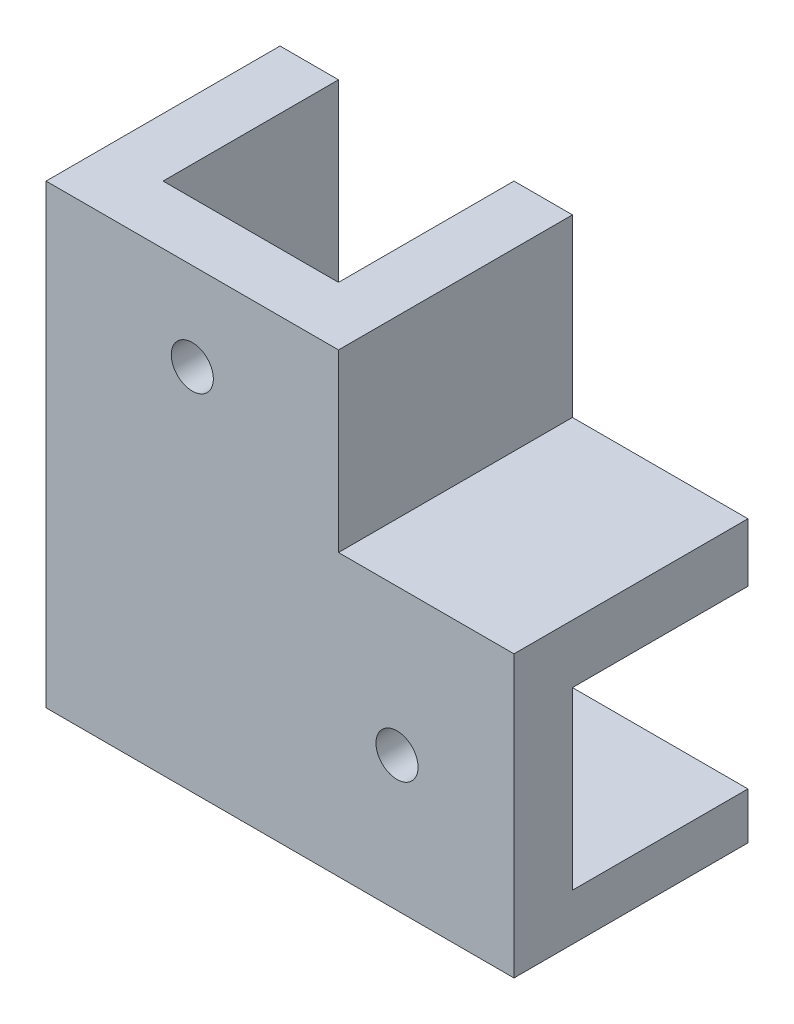
ISO-10303-21;
HEADER;
FILE_DESCRIPTION(('STEP AP214'),'2;1');
FILE_NAME('part.step','',(''),(''),'','','');
FILE_SCHEMA(('AUTOMOTIVE_DESIGN { 1 0 10303 214 1 1 1 1 }'));
ENDSEC;
DATA;
#1=APPLICATION_CONTEXT('core data for automotive mechanical design processes');
#2=APPLICATION_PROTOCOL_DEFINITION('international standard','automotive_design',2000,#1);
#3=PRODUCT_CONTEXT('',#1,'mechanical');
#4=PRODUCT('Part','Part','',(#3));
#5=PRODUCT_RELATED_PRODUCT_CATEGORY('part','',(#4));
#6=PRODUCT_DEFINITION_FORMATION('','',#4);
#7=PRODUCT_DEFINITION_CONTEXT('part definition',#1,'design');
#8=PRODUCT_DEFINITION('design','',#6,#7);
#9=PRODUCT_DEFINITION_SHAPE('','',#8);
#10=(LENGTH_UNIT() NAMED_UNIT(*) SI_UNIT(.MILLI.,.METRE.));
#11=(NAMED_UNIT(*) PLANE_ANGLE_UNIT() SI_UNIT($,.RADIAN.));
#12=(NAMED_UNIT(*) SI_UNIT($,.STERADIAN.) SOLID_ANGLE_UNIT());
#13=UNCERTAINTY_MEASURE_WITH_UNIT(LENGTH_MEASURE(1.E-05),#10,'distance_accuracy_value','');
#14=(GEOMETRIC_REPRESENTATION_CONTEXT(3) GLOBAL_UNCERTAINTY_ASSIGNED_CONTEXT((#13)) GLOBAL_UNIT_ASSIGNED_CONTEXT((#10,
#11,#12)) REPRESENTATION_CONTEXT('',''));
#15=CARTESIAN_POINT('',(0.,0.,0.));
#16=DIRECTION('',(0.,0.,1.));
#17=DIRECTION('',(1.,0.,0.));
#18=AXIS2_PLACEMENT_3D('',#15,#16,#17);
#19=CARTESIAN_POINT('',(0.,0.,-15.));
#20=DIRECTION('',(0.,0.,1.));
#21=DIRECTION('',(1.,0.,0.));
#22=AXIS2_PLACEMENT_3D('',#19,#20,#21);
#23=PLANE('',#22);
#24=DIRECTION('',(1.,0.,0.));
#25=VECTOR('',#24,1.);
#26=CARTESIAN_POINT('',(-12.5298804780876,-10.8067729083665,-15.));
#27=LINE('',#26,#25);
#28=CARTESIAN_POINT('',(-12.5298804780876,-10.8067729083665,-15.));
#29=VERTEX_POINT('',#28);
#30=CARTESIAN_POINT('',(-7.52988047808764,-10.8067729083665,-15.));
#31=VERTEX_POINT('',#30);
#32=EDGE_CURVE('E55',#29,#31,#27,.T.);
#33=ORIENTED_EDGE('',*,*,#32,.F.);
#34=DIRECTION('',(0.,1.,0.));
#35=VECTOR('',#34,1.);
#36=CARTESIAN_POINT('',(-12.5298804780876,-25.8067729083665,-15.));
#37=LINE('',#36,#35);
#38=CARTESIAN_POINT('',(-12.5298804780876,9.19322709163348,-15.));
#39=VERTEX_POINT('',#38);
#40=EDGE_CURVE('E227',#29,#39,#37,.T.);
#41=ORIENTED_EDGE('',*,*,#40,.T.);
#42=DIRECTION('',(1.,0.,0.));
#43=VECTOR('',#42,1.);
#44=CARTESIAN_POINT('',(-7.52988047808764,9.19322709163348,-15.));
#45=LINE('',#44,#43);
#46=CARTESIAN_POINT('',(-7.52988047808764,9.19322709163348,-15.));
#47=VERTEX_POINT('',#46);
#48=EDGE_CURVE('E230',#39,#47,#45,.T.);
#49=ORIENTED_EDGE('',*,*,#48,.T.);
#50=DIRECTION('',(0.,-1.,0.));
#51=VECTOR('',#50,1.);
#52=CARTESIAN_POINT('',(-7.52988047808764,-25.8067729083665,-15.));
#53=LINE('',#52,#51);
#54=EDGE_CURVE('E60',#47,#31,#53,.T.);
#55=ORIENTED_EDGE('',*,*,#54,.T.);
#56=EDGE_LOOP('',(#33,#41,#49,#55));
#57=FACE_BOUND('',#56,.T.);
#58=ADVANCED_FACE('F39',(#57),#23,.F.);
#59=CARTESIAN_POINT('',(7.47011952191236,-10.8067729083665,-15.));
#60=DIRECTION('',(1.,0.,0.));
#61=DIRECTION('',(0.,1.,0.));
#62=AXIS2_PLACEMENT_3D('',#59,#60,#61);
#63=PLANE('',#62);
#64=DIRECTION('',(0.,1.,0.));
#65=VECTOR('',#64,1.);
#66=CARTESIAN_POINT('',(7.47011952191236,9.19322709163348,0.));
#67=LINE('',#66,#65);
#68=CARTESIAN_POINT('',(7.47011952191236,-10.8067729083665,0.));
#69=VERTEX_POINT('',#68);
#70=CARTESIAN_POINT('',(7.47011952191236,9.19322709163348,0.));
#71=VERTEX_POINT('',#70);
#72=EDGE_CURVE('E262',#69,#71,#67,.T.);
#73=ORIENTED_EDGE('',*,*,#72,.T.);
#74=DIRECTION('',(0.,0.,1.));
#75=VECTOR('',#74,1.);
#76=CARTESIAN_POINT('',(7.47011952191236,9.19322709163348,-15.));
#77=LINE('',#76,#75);
#78=CARTESIAN_POINT('',(7.47011952191236,9.19322709163348,-15.));
#79=VERTEX_POINT('',#78);
#80=EDGE_CURVE('E11',#79,#71,#77,.T.);
#81=ORIENTED_EDGE('',*,*,#80,.F.);
#82=DIRECTION('',(0.,1.,0.));
#83=VECTOR('',#82,1.);
#84=CARTESIAN_POINT('',(7.47011952191236,-10.8067729083665,-15.));
#85=LINE('',#84,#83);
#86=CARTESIAN_POINT('',(7.47011952191236,-10.8067729083665,-15.));
#87=VERTEX_POINT('',#86);
#88=EDGE_CURVE('E285',#87,#79,#85,.T.);
#89=ORIENTED_EDGE('',*,*,#88,.F.);
#90=DIRECTION('',(0.,0.,1.));
#91=VECTOR('',#90,1.);
#92=CARTESIAN_POINT('',(7.47011952191236,-10.8067729083665,-15.));
#93=LINE('',#92,#91);
#94=EDGE_CURVE('E304',#87,#69,#93,.T.);
#95=ORIENTED_EDGE('',*,*,#94,.T.);
#96=EDGE_LOOP('',(#73,#81,#89,#95));
#97=FACE_BOUND('',#96,.T.);
#98=ADVANCED_FACE('F41',(#97),#63,.F.);
#99=CARTESIAN_POINT('',(27.4701195219124,-10.8067729083665,-15.));
#100=DIRECTION('',(0.,1.,0.));
#101=DIRECTION('',(-1.,0.,0.));
#102=AXIS2_PLACEMENT_3D('',#99,#100,#101);
#103=PLANE('',#102);
#104=DIRECTION('',(-1.,0.,0.));
#105=VECTOR('',#104,1.);
#106=CARTESIAN_POINT('',(27.4701195219124,-10.8067729083665,0.));
#107=LINE('',#106,#105);
#108=CARTESIAN_POINT('',(27.4701195219124,-10.8067729083665,0.));
#109=VERTEX_POINT('',#108);
#110=EDGE_CURVE('E258',#109,#69,#107,.T.);
#111=ORIENTED_EDGE('',*,*,#110,.T.);
#112=ORIENTED_EDGE('',*,*,#94,.F.);
#113=DIRECTION('',(-1.,0.,0.));
#114=VECTOR('',#113,1.);
#115=CARTESIAN_POINT('',(27.4701195219124,-10.8067729083665,-15.));
#116=LINE('',#115,#114);
#117=CARTESIAN_POINT('',(27.4701195219124,-10.8067729083665,-15.));
#118=VERTEX_POINT('',#117);
#119=EDGE_CURVE('E301',#118,#87,#116,.T.);
#120=ORIENTED_EDGE('',*,*,#119,.F.);
#121=DIRECTION('',(0.,0.,1.));
#122=VECTOR('',#121,1.);
#123=CARTESIAN_POINT('',(27.4701195219124,-10.8067729083665,-15.));
#124=LINE('',#123,#122);
#125=EDGE_CURVE('E308',#118,#109,#124,.T.);
#126=ORIENTED_EDGE('',*,*,#125,.T.);
#127=EDGE_LOOP('',(#111,#112,#120,#126));
#128=FACE_BOUND('',#127,.T.);
#129=ADVANCED_FACE('F385',(#128),#103,.F.);
#130=CARTESIAN_POINT('',(7.47011952191236,9.19322709163348,-15.));
#131=DIRECTION('',(0.,-1.,0.));
#132=DIRECTION('',(0.,0.,-1.));
#133=AXIS2_PLACEMENT_3D('',#130,#131,#132);
#134=PLANE('',#133);
#135=ORIENTED_EDGE('',*,*,#80,.T.);
#136=DIRECTION('',(-1.,0.,0.));
#137=VECTOR('',#136,1.);
#138=CARTESIAN_POINT('',(-7.52988047808764,9.19322709163348,0.));
#139=LINE('',#138,#137);
#140=CARTESIAN_POINT('',(-7.52988047808764,9.19322709163348,0.));
#141=VERTEX_POINT('',#140);
#142=EDGE_CURVE('E266',#71,#141,#139,.T.);
#143=ORIENTED_EDGE('',*,*,#142,.T.);
#144=DIRECTION('',(0.,0.,1.));
#145=VECTOR('',#144,1.);
#146=CARTESIAN_POINT('',(-7.52988047808764,9.19322709163348,-15.));
#147=LINE('',#146,#145);
#148=EDGE_CURVE('E233',#47,#141,#147,.T.);
#149=ORIENTED_EDGE('',*,*,#148,.F.);
#150=ORIENTED_EDGE('',*,*,#48,.F.);
#151=DIRECTION('',(0.,0.,-1.));
#152=VECTOR('',#151,1.);
#153=CARTESIAN_POINT('',(-12.5298804780876,9.19322709163348,5.));
#154=LINE('',#153,#152);
#155=CARTESIAN_POINT('',(-12.5298804780876,9.19322709163348,5.));
#156=VERTEX_POINT('',#155);
#157=EDGE_CURVE('E247',#156,#39,#154,.T.);
#158=ORIENTED_EDGE('',*,*,#157,.F.);
#159=DIRECTION('',(-1.,0.,0.));
#160=VECTOR('',#159,1.);
#161=CARTESIAN_POINT('',(12.4701195219124,9.19322709163348,5.));
#162=LINE('',#161,#160);
#163=CARTESIAN_POINT('',(12.4701195219124,9.19322709163348,5.));
#164=VERTEX_POINT('',#163);
#165=EDGE_CURVE('E270',#164,#156,#162,.T.);
#166=ORIENTED_EDGE('',*,*,#165,.F.);
#167=DIRECTION('',(0.,0.,1.));
#168=VECTOR('',#167,1.);
#169=CARTESIAN_POINT('',(12.4701195219124,9.19322709163348,-15.));
#170=LINE('',#169,#168);
#171=CARTESIAN_POINT('',(12.4701195219124,9.19322709163348,-15.));
#172=VERTEX_POINT('',#171);
#173=EDGE_CURVE('E48',#172,#164,#170,.T.);
#174=ORIENTED_EDGE('',*,*,#173,.F.);
#175=DIRECTION('',(1.,0.,0.));
#176=VECTOR('',#175,1.);
#177=CARTESIAN_POINT('',(7.47011952191236,9.19322709163348,-15.));
#178=LINE('',#177,#176);
#179=EDGE_CURVE('E289',#79,#172,#178,.T.);
#180=ORIENTED_EDGE('',*,*,#179,.F.);
#181=EDGE_LOOP('',(#135,#143,#149,#150,#158,#166,#174,#180));
#182=FACE_BOUND('',#181,.T.);
#183=ADVANCED_FACE('F330',(#182),#134,.F.);
#184=CARTESIAN_POINT('',(12.4701195219124,9.19322709163348,-15.));
#185=DIRECTION('',(-1.,0.,0.));
#186=DIRECTION('',(0.,-1.,0.));
#187=AXIS2_PLACEMENT_3D('',#184,#185,#186);
#188=PLANE('',#187);
#189=ORIENTED_EDGE('',*,*,#173,.T.);
#190=DIRECTION('',(0.,1.,0.));
#191=VECTOR('',#190,1.);
#192=CARTESIAN_POINT('',(12.4701195219124,-5.80677290836653,5.));
#193=LINE('',#192,#191);
#194=CARTESIAN_POINT('',(12.4701195219124,-5.80677290836653,5.));
#195=VERTEX_POINT('',#194);
#196=EDGE_CURVE('E281',#195,#164,#193,.T.);
#197=ORIENTED_EDGE('',*,*,#196,.F.);
#198=DIRECTION('',(0.,0.,1.));
#199=VECTOR('',#198,1.);
#200=CARTESIAN_POINT('',(12.4701195219124,-5.80677290836653,-15.));
#201=LINE('',#200,#199);
#202=CARTESIAN_POINT('',(12.4701195219124,-5.80677290836653,-15.));
#203=VERTEX_POINT('',#202);
#204=EDGE_CURVE('E315',#203,#195,#201,.T.);
#205=ORIENTED_EDGE('',*,*,#204,.F.);
#206=DIRECTION('',(0.,-1.,0.));
#207=VECTOR('',#206,1.);
#208=CARTESIAN_POINT('',(12.4701195219124,9.19322709163348,-15.));
#209=LINE('',#208,#207);
#210=EDGE_CURVE('E292',#172,#203,#209,.T.);
#211=ORIENTED_EDGE('',*,*,#210,.F.);
#212=EDGE_LOOP('',(#189,#197,#205,#211));
#213=FACE_BOUND('',#212,.T.);
#214=ADVANCED_FACE('F322',(#213),#188,.F.);
#215=CARTESIAN_POINT('',(12.4701195219124,-5.80677290836653,-15.));
#216=DIRECTION('',(0.,-1.,0.));
#217=DIRECTION('',(1.,0.,0.));
#218=AXIS2_PLACEMENT_3D('',#215,#216,#217);
#219=PLANE('',#218);
#220=ORIENTED_EDGE('',*,*,#204,.T.);
#221=DIRECTION('',(-1.,0.,0.));
#222=VECTOR('',#221,1.);
#223=CARTESIAN_POINT('',(27.4701195219124,-5.80677290836653,5.));
#224=LINE('',#223,#222);
#225=CARTESIAN_POINT('',(27.4701195219124,-5.80677290836653,5.));
#226=VERTEX_POINT('',#225);
#227=EDGE_CURVE('E277',#226,#195,#224,.T.);
#228=ORIENTED_EDGE('',*,*,#227,.F.);
#229=DIRECTION('',(0.,0.,1.));
#230=VECTOR('',#229,1.);
#231=CARTESIAN_POINT('',(27.4701195219124,-5.80677290836653,-15.));
#232=LINE('',#231,#230);
#233=CARTESIAN_POINT('',(27.4701195219124,-5.80677290836653,-15.));
#234=VERTEX_POINT('',#233);
#235=EDGE_CURVE('E312',#234,#226,#232,.T.);
#236=ORIENTED_EDGE('',*,*,#235,.F.);
#237=DIRECTION('',(1.,0.,0.));
#238=VECTOR('',#237,1.);
#239=CARTESIAN_POINT('',(12.4701195219124,-5.80677290836653,-15.));
#240=LINE('',#239,#238);
#241=EDGE_CURVE('E295',#203,#234,#240,.T.);
#242=ORIENTED_EDGE('',*,*,#241,.F.);
#243=EDGE_LOOP('',(#220,#228,#236,#242));
#244=FACE_BOUND('',#243,.T.);
#245=ADVANCED_FACE('F372',(#244),#219,.F.);
#246=CARTESIAN_POINT('',(27.4701195219124,-10.8067729083665,-15.));
#247=DIRECTION('',(-1.,0.,0.));
#248=DIRECTION('',(0.,0.,1.));
#249=AXIS2_PLACEMENT_3D('',#246,#247,#248);
#250=PLANE('',#249);
#251=ORIENTED_EDGE('',*,*,#235,.T.);
#252=DIRECTION('',(0.,1.,0.));
#253=VECTOR('',#252,1.);
#254=CARTESIAN_POINT('',(27.4701195219124,-10.8067729083665,5.));
#255=LINE('',#254,#253);
#256=CARTESIAN_POINT('',(27.4701195219124,-29.8067729083665,5.));
#257=VERTEX_POINT('',#256);
#258=EDGE_CURVE('E273',#257,#226,#255,.T.);
#259=ORIENTED_EDGE('',*,*,#258,.F.);
#260=DIRECTION('',(0.,0.,1.));
#261=VECTOR('',#260,1.);
#262=CARTESIAN_POINT('',(27.4701195219124,-29.8067729083665,5.));
#263=LINE('',#262,#261);
#264=CARTESIAN_POINT('',(27.4701195219124,-29.8067729083665,-15.));
#265=VERTEX_POINT('',#264);
#266=EDGE_CURVE('E163',#265,#257,#263,.T.);
#267=ORIENTED_EDGE('',*,*,#266,.F.);
#268=DIRECTION('',(0.,1.,0.));
#269=VECTOR('',#268,1.);
#270=CARTESIAN_POINT('',(27.4701195219124,-29.8067729083665,-15.));
#271=LINE('',#270,#269);
#272=CARTESIAN_POINT('',(27.4701195219124,-25.8067729083665,-15.));
#273=VERTEX_POINT('',#272);
#274=EDGE_CURVE('E158',#265,#273,#271,.T.);
#275=ORIENTED_EDGE('',*,*,#274,.T.);
#276=DIRECTION('',(0.,0.,1.));
#277=VECTOR('',#276,1.);
#278=CARTESIAN_POINT('',(27.4701195219124,-25.8067729083665,5.));
#279=LINE('',#278,#277);
#280=CARTESIAN_POINT('',(27.4701195219124,-25.8067729083665,0.));
#281=VERTEX_POINT('',#280);
#282=EDGE_CURVE('E356',#273,#281,#279,.T.);
#283=ORIENTED_EDGE('',*,*,#282,.T.);
#284=DIRECTION('',(0.,1.,0.));
#285=VECTOR('',#284,1.);
#286=CARTESIAN_POINT('',(27.4701195219124,-25.8067729083665,0.));
#287=LINE('',#286,#285);
#288=EDGE_CURVE('E255',#281,#109,#287,.T.);
#289=ORIENTED_EDGE('',*,*,#288,.T.);
#290=ORIENTED_EDGE('',*,*,#125,.F.);
#291=DIRECTION('',(0.,-1.,0.));
#292=VECTOR('',#291,1.);
#293=CARTESIAN_POINT('',(27.4701195219124,-10.8067729083665,-15.));
#294=LINE('',#293,#292);
#295=EDGE_CURVE('E298',#234,#118,#294,.T.);
#296=ORIENTED_EDGE('',*,*,#295,.F.);
#297=EDGE_LOOP('',(#251,#259,#267,#275,#283,#289,#290,#296));
#298=FACE_BOUND('',#297,.T.);
#299=ADVANCED_FACE('F368',(#298),#250,.F.);
#300=CARTESIAN_POINT('',(0.,0.,-15.));
#301=DIRECTION('',(0.,0.,-1.));
#302=DIRECTION('',(-1.,0.,0.));
#303=AXIS2_PLACEMENT_3D('',#300,#301,#302);
#304=PLANE('',#303);
#305=ORIENTED_EDGE('',*,*,#88,.T.);
#306=ORIENTED_EDGE('',*,*,#179,.T.);
#307=ORIENTED_EDGE('',*,*,#210,.T.);
#308=ORIENTED_EDGE('',*,*,#241,.T.);
#309=ORIENTED_EDGE('',*,*,#295,.T.);
#310=ORIENTED_EDGE('',*,*,#119,.T.);
#311=EDGE_LOOP('',(#305,#306,#307,#308,#309,#310));
#312=FACE_BOUND('',#311,.T.);
#313=ADVANCED_FACE('F375',(#312),#304,.T.);
#314=CARTESIAN_POINT('',(0.,0.,5.));
#315=DIRECTION('',(0.,0.,1.));
#316=DIRECTION('',(1.,0.,0.));
#317=AXIS2_PLACEMENT_3D('',#314,#315,#316);
#318=PLANE('',#317);
#319=CARTESIAN_POINT('',(-0.0298804780876445,1.69322709163348,5.));
#320=DIRECTION('',(0.,0.,-1.));
#321=DIRECTION('',(-1.,0.,0.));
#322=AXIS2_PLACEMENT_3D('',#319,#320,#321);
#323=CIRCLE('',#322,1.8);
#324=CARTESIAN_POINT('',(-1.82988047808764,1.69322709163348,5.));
#325=VERTEX_POINT('',#324);
#326=EDGE_CURVE('E209',#325,#325,#323,.T.);
#327=ORIENTED_EDGE('',*,*,#326,.T.);
#328=EDGE_LOOP('',(#327));
#329=FACE_BOUND('',#328,.T.);
#330=CARTESIAN_POINT('',(17.4701195219124,-18.3067729083665,5.));
#331=DIRECTION('',(0.,0.,-1.));
#332=DIRECTION('',(-1.,0.,0.));
#333=AXIS2_PLACEMENT_3D('',#330,#331,#332);
#334=CIRCLE('',#333,1.8);
#335=CARTESIAN_POINT('',(15.6701195219124,-18.3067729083665,5.));
#336=VERTEX_POINT('',#335);
#337=EDGE_CURVE('E218',#336,#336,#334,.T.);
#338=ORIENTED_EDGE('',*,*,#337,.T.);
#339=EDGE_LOOP('',(#338));
#340=FACE_BOUND('',#339,.T.);
#341=DIRECTION('',(0.,-1.,0.));
#342=VECTOR('',#341,1.);
#343=CARTESIAN_POINT('',(-12.5298804780876,9.19322709163348,5.));
#344=LINE('',#343,#342);
#345=CARTESIAN_POINT('',(-12.5298804780876,-29.8067729083665,5.));
#346=VERTEX_POINT('',#345);
#347=EDGE_CURVE('E244',#156,#346,#344,.T.);
#348=ORIENTED_EDGE('',*,*,#347,.T.);
#349=DIRECTION('',(-1.,0.,0.));
#350=VECTOR('',#349,1.);
#351=CARTESIAN_POINT('',(27.4701195219124,-29.8067729083665,5.));
#352=LINE('',#351,#350);
#353=EDGE_CURVE('E340',#257,#346,#352,.T.);
#354=ORIENTED_EDGE('',*,*,#353,.F.);
#355=ORIENTED_EDGE('',*,*,#258,.T.);
#356=ORIENTED_EDGE('',*,*,#227,.T.);
#357=ORIENTED_EDGE('',*,*,#196,.T.);
#358=ORIENTED_EDGE('',*,*,#165,.T.);
#359=EDGE_LOOP('',(#348,#354,#355,#356,#357,#358));
#360=FACE_BOUND('',#359,.T.);
#361=ADVANCED_FACE('F327',(#329,#340,#360),#318,.T.);
#362=CARTESIAN_POINT('',(0.,0.,0.));
#363=DIRECTION('',(0.,0.,1.));
#364=DIRECTION('',(1.,0.,0.));
#365=AXIS2_PLACEMENT_3D('',#362,#363,#364);
#366=PLANE('',#365);
#367=CARTESIAN_POINT('',(-0.0298804780876445,1.69322709163348,0.));
#368=DIRECTION('',(0.,0.,-1.));
#369=DIRECTION('',(-1.,0.,0.));
#370=AXIS2_PLACEMENT_3D('',#367,#368,#369);
#371=CIRCLE('',#370,1.8);
#372=CARTESIAN_POINT('',(-1.82988047808764,1.69322709163348,0.));
#373=VERTEX_POINT('',#372);
#374=EDGE_CURVE('E214',#373,#373,#371,.T.);
#375=ORIENTED_EDGE('',*,*,#374,.F.);
#376=EDGE_LOOP('',(#375));
#377=FACE_BOUND('',#376,.T.);
#378=CARTESIAN_POINT('',(17.4701195219124,-18.3067729083665,0.));
#379=DIRECTION('',(0.,0.,-1.));
#380=DIRECTION('',(-1.,0.,0.));
#381=AXIS2_PLACEMENT_3D('',#378,#379,#380);
#382=CIRCLE('',#381,1.8);
#383=CARTESIAN_POINT('',(15.6701195219124,-18.3067729083665,0.));
#384=VERTEX_POINT('',#383);
#385=EDGE_CURVE('E208',#384,#384,#382,.T.);
#386=ORIENTED_EDGE('',*,*,#385,.F.);
#387=EDGE_LOOP('',(#386));
#388=FACE_BOUND('',#387,.T.);
#389=DIRECTION('',(0.,-1.,0.));
#390=VECTOR('',#389,1.);
#391=CARTESIAN_POINT('',(-7.52988047808764,-25.8067729083665,0.));
#392=LINE('',#391,#390);
#393=CARTESIAN_POINT('',(-7.52988047808764,-25.8067729083665,0.));
#394=VERTEX_POINT('',#393);
#395=EDGE_CURVE('E213',#141,#394,#392,.T.);
#396=ORIENTED_EDGE('',*,*,#395,.F.);
#397=ORIENTED_EDGE('',*,*,#142,.F.);
#398=ORIENTED_EDGE('',*,*,#72,.F.);
#399=ORIENTED_EDGE('',*,*,#110,.F.);
#400=ORIENTED_EDGE('',*,*,#288,.F.);
#401=DIRECTION('',(1.,0.,0.));
#402=VECTOR('',#401,1.);
#403=CARTESIAN_POINT('',(-7.52988047808764,-25.8067729083665,0.));
#404=LINE('',#403,#402);
#405=EDGE_CURVE('E251',#394,#281,#404,.T.);
#406=ORIENTED_EDGE('',*,*,#405,.F.);
#407=EDGE_LOOP('',(#396,#397,#398,#399,#400,#406));
#408=FACE_BOUND('',#407,.T.);
#409=ADVANCED_FACE('F383',(#377,#388,#408),#366,.F.);
#410=CARTESIAN_POINT('',(-12.5298804780876,9.19322709163348,5.));
#411=DIRECTION('',(1.,0.,0.));
#412=DIRECTION('',(0.,1.,0.));
#413=AXIS2_PLACEMENT_3D('',#410,#411,#412);
#414=PLANE('',#413);
#415=ORIENTED_EDGE('',*,*,#157,.T.);
#416=ORIENTED_EDGE('',*,*,#40,.F.);
#417=DIRECTION('',(0.,0.,1.));
#418=VECTOR('',#417,1.);
#419=CARTESIAN_POINT('',(-12.5298804780876,-10.8067729083665,-28.));
#420=LINE('',#419,#418);
#421=CARTESIAN_POINT('',(-12.5298804780876,-10.8067729083665,-28.));
#422=VERTEX_POINT('',#421);
#423=EDGE_CURVE('E204',#422,#29,#420,.T.);
#424=ORIENTED_EDGE('',*,*,#423,.F.);
#425=DIRECTION('',(0.,1.,0.));
#426=VECTOR('',#425,1.);
#427=CARTESIAN_POINT('',(-12.5298804780876,-10.8067729083665,-28.));
#428=LINE('',#427,#426);
#429=CARTESIAN_POINT('',(-12.5298804780876,-29.8067729083665,-28.));
#430=VERTEX_POINT('',#429);
#431=EDGE_CURVE('E184',#430,#422,#428,.T.);
#432=ORIENTED_EDGE('',*,*,#431,.F.);
#433=DIRECTION('',(0.,0.,-1.));
#434=VECTOR('',#433,1.);
#435=CARTESIAN_POINT('',(-12.5298804780876,-29.8067729083665,-28.));
#436=LINE('',#435,#434);
#437=EDGE_CURVE('E337',#346,#430,#436,.T.);
#438=ORIENTED_EDGE('',*,*,#437,.F.);
#439=ORIENTED_EDGE('',*,*,#347,.F.);
#440=EDGE_LOOP('',(#415,#416,#424,#432,#438,#439));
#441=FACE_BOUND('',#440,.T.);
#442=ADVANCED_FACE('F336',(#441),#414,.F.);
#443=CARTESIAN_POINT('',(-7.52988047808764,-25.8067729083665,-15.));
#444=DIRECTION('',(-1.,0.,0.));
#445=DIRECTION('',(0.,-1.,0.));
#446=AXIS2_PLACEMENT_3D('',#443,#444,#445);
#447=PLANE('',#446);
#448=ORIENTED_EDGE('',*,*,#395,.T.);
#449=DIRECTION('',(0.,0.,1.));
#450=VECTOR('',#449,1.);
#451=CARTESIAN_POINT('',(-7.52988047808764,-25.8067729083665,-15.));
#452=LINE('',#451,#450);
#453=CARTESIAN_POINT('',(-7.52988047808764,-25.8067729083665,-28.));
#454=VERTEX_POINT('',#453);
#455=EDGE_CURVE('E240',#454,#394,#452,.T.);
#456=ORIENTED_EDGE('',*,*,#455,.F.);
#457=DIRECTION('',(0.,-1.,0.));
#458=VECTOR('',#457,1.);
#459=CARTESIAN_POINT('',(-7.52988047808764,-10.8067729083665,-28.));
#460=LINE('',#459,#458);
#461=CARTESIAN_POINT('',(-7.52988047808764,-10.8067729083665,-28.));
#462=VERTEX_POINT('',#461);
#463=EDGE_CURVE('E196',#462,#454,#460,.T.);
#464=ORIENTED_EDGE('',*,*,#463,.F.);
#465=DIRECTION('',(0.,0.,1.));
#466=VECTOR('',#465,1.);
#467=CARTESIAN_POINT('',(-7.52988047808764,-10.8067729083665,-28.));
#468=LINE('',#467,#466);
#469=EDGE_CURVE('E199',#462,#31,#468,.T.);
#470=ORIENTED_EDGE('',*,*,#469,.T.);
#471=ORIENTED_EDGE('',*,*,#54,.F.);
#472=ORIENTED_EDGE('',*,*,#148,.T.);
#473=EDGE_LOOP('',(#448,#456,#464,#470,#471,#472));
#474=FACE_BOUND('',#473,.T.);
#475=ADVANCED_FACE('F389',(#474),#447,.F.);
#476=CARTESIAN_POINT('',(17.4701195219124,-18.3067729083665,5.));
#477=DIRECTION('',(0.,0.,-1.));
#478=DIRECTION('',(-1.,0.,0.));
#479=AXIS2_PLACEMENT_3D('',#476,#477,#478);
#480=CYLINDRICAL_SURFACE('',#479,1.8);
#481=ORIENTED_EDGE('',*,*,#337,.F.);
#482=EDGE_LOOP('',(#481));
#483=FACE_BOUND('',#482,.T.);
#484=ORIENTED_EDGE('',*,*,#385,.T.);
#485=EDGE_LOOP('',(#484));
#486=FACE_BOUND('',#485,.T.);
#487=ADVANCED_FACE('F404',(#483,#486),#480,.F.);
#488=CARTESIAN_POINT('',(-0.0298804780876445,1.69322709163348,5.));
#489=DIRECTION('',(0.,0.,-1.));
#490=DIRECTION('',(-1.,0.,0.));
#491=AXIS2_PLACEMENT_3D('',#488,#489,#490);
#492=CYLINDRICAL_SURFACE('',#491,1.8);
#493=ORIENTED_EDGE('',*,*,#326,.F.);
#494=EDGE_LOOP('',(#493));
#495=FACE_BOUND('',#494,.T.);
#496=ORIENTED_EDGE('',*,*,#374,.T.);
#497=EDGE_LOOP('',(#496));
#498=FACE_BOUND('',#497,.T.);
#499=ADVANCED_FACE('F459',(#495,#498),#492,.F.);
#500=CARTESIAN_POINT('',(-12.5298804780876,-10.8067729083665,-28.));
#501=DIRECTION('',(0.,-1.,0.));
#502=DIRECTION('',(0.,0.,-1.));
#503=AXIS2_PLACEMENT_3D('',#500,#501,#502);
#504=PLANE('',#503);
#505=ORIENTED_EDGE('',*,*,#32,.T.);
#506=ORIENTED_EDGE('',*,*,#469,.F.);
#507=DIRECTION('',(1.,0.,0.));
#508=VECTOR('',#507,1.);
#509=CARTESIAN_POINT('',(-12.5298804780876,-10.8067729083665,-28.));
#510=LINE('',#509,#508);
#511=EDGE_CURVE('E193',#422,#462,#510,.T.);
#512=ORIENTED_EDGE('',*,*,#511,.F.);
#513=ORIENTED_EDGE('',*,*,#423,.T.);
#514=EDGE_LOOP('',(#505,#506,#512,#513));
#515=FACE_BOUND('',#514,.T.);
#516=ADVANCED_FACE('F394',(#515),#504,.F.);
#517=CARTESIAN_POINT('',(0.,0.,-28.));
#518=DIRECTION('',(0.,0.,-1.));
#519=DIRECTION('',(-1.,0.,0.));
#520=AXIS2_PLACEMENT_3D('',#517,#518,#519);
#521=PLANE('',#520);
#522=ORIENTED_EDGE('',*,*,#431,.T.);
#523=ORIENTED_EDGE('',*,*,#511,.T.);
#524=ORIENTED_EDGE('',*,*,#463,.T.);
#525=DIRECTION('',(1.,0.,0.));
#526=VECTOR('',#525,1.);
#527=CARTESIAN_POINT('',(7.47011952191236,-25.8067729083665,-28.));
#528=LINE('',#527,#526);
#529=CARTESIAN_POINT('',(7.47011952191236,-25.8067729083665,-28.));
#530=VERTEX_POINT('',#529);
#531=EDGE_CURVE('E175',#454,#530,#528,.T.);
#532=ORIENTED_EDGE('',*,*,#531,.T.);
#533=DIRECTION('',(0.,1.,0.));
#534=VECTOR('',#533,1.);
#535=CARTESIAN_POINT('',(7.47011952191236,-29.8067729083665,-28.));
#536=LINE('',#535,#534);
#537=CARTESIAN_POINT('',(7.47011952191236,-29.8067729083665,-28.));
#538=VERTEX_POINT('',#537);
#539=EDGE_CURVE('E186',#538,#530,#536,.T.);
#540=ORIENTED_EDGE('',*,*,#539,.F.);
#541=DIRECTION('',(1.,0.,0.));
#542=VECTOR('',#541,1.);
#543=CARTESIAN_POINT('',(7.47011952191236,-29.8067729083665,-28.));
#544=LINE('',#543,#542);
#545=EDGE_CURVE('E170',#430,#538,#544,.T.);
#546=ORIENTED_EDGE('',*,*,#545,.F.);
#547=EDGE_LOOP('',(#522,#523,#524,#532,#540,#546));
#548=FACE_BOUND('',#547,.T.);
#549=ADVANCED_FACE('F390',(#548),#521,.T.);
#550=CARTESIAN_POINT('',(0.,-25.8067729083665,0.));
#551=DIRECTION('',(0.,-1.,0.));
#552=DIRECTION('',(0.,0.,-1.));
#553=AXIS2_PLACEMENT_3D('',#550,#551,#552);
#554=PLANE('',#553);
#555=CARTESIAN_POINT('',(-0.0298804780876436,-25.8067729083665,-20.5));
#556=DIRECTION('',(0.,-1.,0.));
#557=DIRECTION('',(0.,0.,-1.));
#558=AXIS2_PLACEMENT_3D('',#555,#556,#557);
#559=CIRCLE('',#558,1.5);
#560=CARTESIAN_POINT('',(-0.0298804780876436,-25.8067729083665,-22.));
#561=VERTEX_POINT('',#560);
#562=EDGE_CURVE('E353',#561,#561,#559,.T.);
#563=ORIENTED_EDGE('',*,*,#562,.T.);
#564=EDGE_LOOP('',(#563));
#565=FACE_BOUND('',#564,.T.);
#566=ORIENTED_EDGE('',*,*,#531,.F.);
#567=ORIENTED_EDGE('',*,*,#455,.T.);
#568=ORIENTED_EDGE('',*,*,#405,.T.);
#569=ORIENTED_EDGE('',*,*,#282,.F.);
#570=DIRECTION('',(1.,0.,0.));
#571=VECTOR('',#570,1.);
#572=CARTESIAN_POINT('',(27.4701195219124,-25.8067729083665,-15.));
#573=LINE('',#572,#571);
#574=CARTESIAN_POINT('',(7.47011952191236,-25.8067729083665,-15.));
#575=VERTEX_POINT('',#574);
#576=EDGE_CURVE('E352',#575,#273,#573,.T.);
#577=ORIENTED_EDGE('',*,*,#576,.F.);
#578=DIRECTION('',(0.,0.,1.));
#579=VECTOR('',#578,1.);
#580=CARTESIAN_POINT('',(7.47011952191236,-25.8067729083665,-28.));
#581=LINE('',#580,#579);
#582=EDGE_CURVE('E179',#530,#575,#581,.T.);
#583=ORIENTED_EDGE('',*,*,#582,.F.);
#584=EDGE_LOOP('',(#566,#567,#568,#569,#577,#583));
#585=FACE_BOUND('',#584,.T.);
#586=ADVANCED_FACE('F365',(#565,#585),#554,.F.);
#587=CARTESIAN_POINT('',(7.47011952191236,-29.8067729083665,-28.));
#588=DIRECTION('',(-1.,0.,0.));
#589=DIRECTION('',(0.,0.,1.));
#590=AXIS2_PLACEMENT_3D('',#587,#588,#589);
#591=PLANE('',#590);
#592=ORIENTED_EDGE('',*,*,#582,.T.);
#593=DIRECTION('',(0.,1.,0.));
#594=VECTOR('',#593,1.);
#595=CARTESIAN_POINT('',(7.47011952191236,-29.8067729083665,-15.));
#596=LINE('',#595,#594);
#597=CARTESIAN_POINT('',(7.47011952191236,-29.8067729083665,-15.));
#598=VERTEX_POINT('',#597);
#599=EDGE_CURVE('E155',#598,#575,#596,.T.);
#600=ORIENTED_EDGE('',*,*,#599,.F.);
#601=DIRECTION('',(0.,0.,1.));
#602=VECTOR('',#601,1.);
#603=CARTESIAN_POINT('',(7.47011952191236,-29.8067729083665,-28.));
#604=LINE('',#603,#602);
#605=EDGE_CURVE('E164',#538,#598,#604,.T.);
#606=ORIENTED_EDGE('',*,*,#605,.F.);
#607=ORIENTED_EDGE('',*,*,#539,.T.);
#608=EDGE_LOOP('',(#592,#600,#606,#607));
#609=FACE_BOUND('',#608,.T.);
#610=ADVANCED_FACE('F177',(#609),#591,.F.);
#611=CARTESIAN_POINT('',(27.4701195219124,-29.8067729083665,-15.));
#612=DIRECTION('',(0.,0.,1.));
#613=DIRECTION('',(1.,0.,0.));
#614=AXIS2_PLACEMENT_3D('',#611,#612,#613);
#615=PLANE('',#614);
#616=ORIENTED_EDGE('',*,*,#576,.T.);
#617=ORIENTED_EDGE('',*,*,#274,.F.);
#618=DIRECTION('',(1.,0.,0.));
#619=VECTOR('',#618,1.);
#620=CARTESIAN_POINT('',(27.4701195219124,-29.8067729083665,-15.));
#621=LINE('',#620,#619);
#622=EDGE_CURVE('E151',#598,#265,#621,.T.);
#623=ORIENTED_EDGE('',*,*,#622,.F.);
#624=ORIENTED_EDGE('',*,*,#599,.T.);
#625=EDGE_LOOP('',(#616,#617,#623,#624));
#626=FACE_BOUND('',#625,.T.);
#627=ADVANCED_FACE('F153',(#626),#615,.F.);
#628=CARTESIAN_POINT('',(0.,-29.8067729083665,0.));
#629=DIRECTION('',(0.,-1.,0.));
#630=DIRECTION('',(0.,0.,-1.));
#631=AXIS2_PLACEMENT_3D('',#628,#629,#630);
#632=PLANE('',#631);
#633=CARTESIAN_POINT('',(-0.0298804780876436,-29.8067729083665,-20.5));
#634=DIRECTION('',(0.,-1.,0.));
#635=DIRECTION('',(0.,0.,-1.));
#636=AXIS2_PLACEMENT_3D('',#633,#634,#635);
#637=CIRCLE('',#636,1.5);
#638=CARTESIAN_POINT('',(-0.0298804780876436,-29.8067729083665,-22.));
#639=VERTEX_POINT('',#638);
#640=EDGE_CURVE('E637',#639,#639,#637,.T.);
#641=ORIENTED_EDGE('',*,*,#640,.F.);
#642=EDGE_LOOP('',(#641));
#643=FACE_BOUND('',#642,.T.);
#644=ORIENTED_EDGE('',*,*,#605,.T.);
#645=ORIENTED_EDGE('',*,*,#622,.T.);
#646=ORIENTED_EDGE('',*,*,#266,.T.);
#647=ORIENTED_EDGE('',*,*,#353,.T.);
#648=ORIENTED_EDGE('',*,*,#437,.T.);
#649=ORIENTED_EDGE('',*,*,#545,.T.);
#650=EDGE_LOOP('',(#644,#645,#646,#647,#648,#649));
#651=FACE_BOUND('',#650,.T.);
#652=ADVANCED_FACE('F167',(#643,#651),#632,.T.);
#653=CARTESIAN_POINT('',(-0.0298804780876436,9.19322709163348,-20.5));
#654=DIRECTION('',(0.,-1.,0.));
#655=DIRECTION('',(0.,0.,-1.));
#656=AXIS2_PLACEMENT_3D('',#653,#654,#655);
#657=CYLINDRICAL_SURFACE('',#656,1.5);
#658=ORIENTED_EDGE('',*,*,#640,.T.);
#659=EDGE_LOOP('',(#658));
#660=FACE_BOUND('',#659,.T.);
#661=ORIENTED_EDGE('',*,*,#562,.F.);
#662=EDGE_LOOP('',(#661));
#663=FACE_BOUND('',#662,.T.);
#664=ADVANCED_FACE('F520',(#660,#663),#657,.F.);
#665=CLOSED_SHELL('',(#58,#98,#129,#183,#214,#245,#299,#313,#361,#409,#442,#475,#487,#499,#516,
#549,#586,#610,#627,#652,#664));
#666=MANIFOLD_SOLID_BREP('B2',#665);
#667=ADVANCED_BREP_SHAPE_REPRESENTATION('',(#18,#666),#14);
#668=SHAPE_DEFINITION_REPRESENTATION(#9,#667);
ENDSEC;
END-ISO-10303-21;
